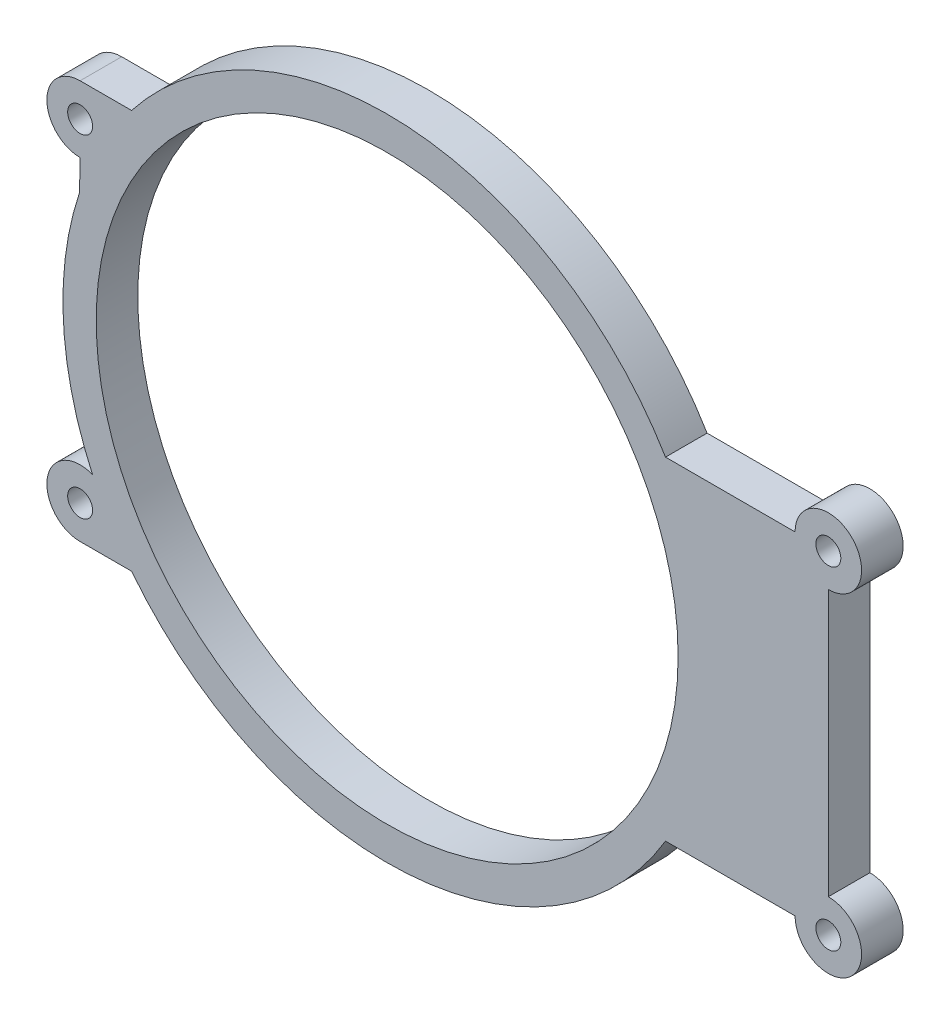
ISO-10303-21;
HEADER;
FILE_DESCRIPTION(('STEP AP214'),'2;1');
FILE_NAME('part.step','',(''),(''),'','','');
FILE_SCHEMA(('AUTOMOTIVE_DESIGN { 1 0 10303 214 1 1 1 1 }'));
ENDSEC;
DATA;
#1=APPLICATION_CONTEXT('core data for automotive mechanical design processes');
#2=APPLICATION_PROTOCOL_DEFINITION('international standard','automotive_design',2000,#1);
#3=PRODUCT_CONTEXT('',#1,'mechanical');
#4=PRODUCT('Part','Part','',(#3));
#5=PRODUCT_RELATED_PRODUCT_CATEGORY('part','',(#4));
#6=PRODUCT_DEFINITION_FORMATION('','',#4);
#7=PRODUCT_DEFINITION_CONTEXT('part definition',#1,'design');
#8=PRODUCT_DEFINITION('design','',#6,#7);
#9=PRODUCT_DEFINITION_SHAPE('','',#8);
#10=(LENGTH_UNIT() NAMED_UNIT(*) SI_UNIT(.MILLI.,.METRE.));
#11=(NAMED_UNIT(*) PLANE_ANGLE_UNIT() SI_UNIT($,.RADIAN.));
#12=(NAMED_UNIT(*) SI_UNIT($,.STERADIAN.) SOLID_ANGLE_UNIT());
#13=UNCERTAINTY_MEASURE_WITH_UNIT(LENGTH_MEASURE(1.E-05),#10,'distance_accuracy_value','');
#14=(GEOMETRIC_REPRESENTATION_CONTEXT(3) GLOBAL_UNCERTAINTY_ASSIGNED_CONTEXT((#13)) GLOBAL_UNIT_ASSIGNED_CONTEXT((#10,
#11,#12)) REPRESENTATION_CONTEXT('',''));
#15=CARTESIAN_POINT('',(0.,0.,0.));
#16=DIRECTION('',(0.,0.,1.));
#17=DIRECTION('',(1.,0.,0.));
#18=AXIS2_PLACEMENT_3D('',#15,#16,#17);
#19=CARTESIAN_POINT('',(0.,24.,5.));
#20=DIRECTION('',(0.,1.,0.));
#21=DIRECTION('',(0.,0.,1.));
#22=AXIS2_PLACEMENT_3D('',#19,#20,#21);
#23=PLANE('',#22);
#24=DIRECTION('',(1.,0.,0.));
#25=VECTOR('',#24,1.);
#26=CARTESIAN_POINT('',(0.,24.,0.));
#27=LINE('',#26,#25);
#28=CARTESIAN_POINT('',(-36.9323706252388,24.,0.));
#29=VERTEX_POINT('',#28);
#30=CARTESIAN_POINT('',(-30.7408522978788,24.,0.));
#31=VERTEX_POINT('',#30);
#32=EDGE_CURVE('E221',#29,#31,#27,.T.);
#33=ORIENTED_EDGE('',*,*,#32,.F.);
#34=DIRECTION('',(0.,0.,-1.));
#35=VECTOR('',#34,1.);
#36=CARTESIAN_POINT('',(-36.9323706252388,24.,5.));
#37=LINE('',#36,#35);
#38=CARTESIAN_POINT('',(-36.9323706252388,24.,5.));
#39=VERTEX_POINT('',#38);
#40=EDGE_CURVE('E11',#39,#29,#37,.T.);
#41=ORIENTED_EDGE('',*,*,#40,.F.);
#42=DIRECTION('',(1.,0.,0.));
#43=VECTOR('',#42,1.);
#44=CARTESIAN_POINT('',(0.,24.,5.));
#45=LINE('',#44,#43);
#46=CARTESIAN_POINT('',(-30.7408522978788,24.,5.));
#47=VERTEX_POINT('',#46);
#48=EDGE_CURVE('E361',#39,#47,#45,.T.);
#49=ORIENTED_EDGE('',*,*,#48,.T.);
#50=DIRECTION('',(0.,0.,-1.));
#51=VECTOR('',#50,1.);
#52=CARTESIAN_POINT('',(-30.7408522978788,24.,5.));
#53=LINE('',#52,#51);
#54=EDGE_CURVE('E112',#47,#31,#53,.T.);
#55=ORIENTED_EDGE('',*,*,#54,.T.);
#56=EDGE_LOOP('',(#33,#41,#49,#55));
#57=FACE_BOUND('',#56,.T.);
#58=ADVANCED_FACE('F45',(#57),#23,.T.);
#59=CARTESIAN_POINT('',(-36.9323706252388,20.,5.));
#60=DIRECTION('',(0.,0.,-1.));
#61=DIRECTION('',(-1.,0.,0.));
#62=AXIS2_PLACEMENT_3D('',#59,#60,#61);
#63=CYLINDRICAL_SURFACE('',#62,4.);
#64=CARTESIAN_POINT('',(-36.9323706252388,20.,0.));
#65=DIRECTION('',(0.,0.,1.));
#66=DIRECTION('',(1.,0.,0.));
#67=AXIS2_PLACEMENT_3D('',#64,#65,#66);
#68=CIRCLE('',#67,4.);
#69=CARTESIAN_POINT('',(-36.9323706252388,16.,0.));
#70=VERTEX_POINT('',#69);
#71=EDGE_CURVE('E218',#29,#70,#68,.T.);
#72=ORIENTED_EDGE('',*,*,#71,.T.);
#73=DIRECTION('',(0.,0.,-1.));
#74=VECTOR('',#73,1.);
#75=CARTESIAN_POINT('',(-36.9323706252388,16.,5.));
#76=LINE('',#75,#74);
#77=CARTESIAN_POINT('',(-36.9323706252388,16.,5.));
#78=VERTEX_POINT('',#77);
#79=EDGE_CURVE('E55',#78,#70,#76,.T.);
#80=ORIENTED_EDGE('',*,*,#79,.F.);
#81=CARTESIAN_POINT('',(-36.9323706252388,20.,5.));
#82=DIRECTION('',(0.,0.,1.));
#83=DIRECTION('',(1.,0.,0.));
#84=AXIS2_PLACEMENT_3D('',#81,#82,#83);
#85=CIRCLE('',#84,4.);
#86=EDGE_CURVE('E364',#39,#78,#85,.T.);
#87=ORIENTED_EDGE('',*,*,#86,.F.);
#88=ORIENTED_EDGE('',*,*,#40,.T.);
#89=EDGE_LOOP('',(#72,#80,#87,#88));
#90=FACE_BOUND('',#89,.T.);
#91=ADVANCED_FACE('F219',(#90),#63,.T.);
#92=CARTESIAN_POINT('',(-37.2251242057129,0.712873570111216,5.));
#93=DIRECTION('',(0.999816682769667,-0.0191468236388955,0.));
#94=DIRECTION('',(0.0191468236388955,0.999816682769667,0.));
#95=AXIS2_PLACEMENT_3D('',#92,#93,#94);
#96=PLANE('',#95);
#97=DIRECTION('',(-0.0191468236388955,-0.999816682769667,0.));
#98=VECTOR('',#97,1.);
#99=CARTESIAN_POINT('',(-37.2251242057129,0.712873570111216,0.));
#100=LINE('',#99,#98);
#101=CARTESIAN_POINT('',(-37.0028379618966,12.320307738268,0.));
#102=VERTEX_POINT('',#101);
#103=EDGE_CURVE('E212',#70,#102,#100,.T.);
#104=ORIENTED_EDGE('',*,*,#103,.T.);
#105=DIRECTION('',(0.,0.,-1.));
#106=VECTOR('',#105,1.);
#107=CARTESIAN_POINT('',(-37.0028379618966,12.320307738268,5.));
#108=LINE('',#107,#106);
#109=CARTESIAN_POINT('',(-37.0028379618966,12.320307738268,5.));
#110=VERTEX_POINT('',#109);
#111=EDGE_CURVE('E201',#110,#102,#108,.T.);
#112=ORIENTED_EDGE('',*,*,#111,.F.);
#113=DIRECTION('',(-0.0191468236388955,-0.999816682769667,0.));
#114=VECTOR('',#113,1.);
#115=CARTESIAN_POINT('',(-37.2251242057129,0.712873570111216,5.));
#116=LINE('',#115,#114);
#117=EDGE_CURVE('E214',#78,#110,#116,.T.);
#118=ORIENTED_EDGE('',*,*,#117,.F.);
#119=ORIENTED_EDGE('',*,*,#79,.T.);
#120=EDGE_LOOP('',(#104,#112,#118,#119));
#121=FACE_BOUND('',#120,.T.);
#122=ADVANCED_FACE('F210',(#121),#96,.F.);
#123=CARTESIAN_POINT('',(0.,0.,5.));
#124=DIRECTION('',(0.,0.,-1.));
#125=DIRECTION('',(-1.,0.,0.));
#126=AXIS2_PLACEMENT_3D('',#123,#124,#125);
#127=CYLINDRICAL_SURFACE('',#126,39.);
#128=CARTESIAN_POINT('',(0.,0.,0.));
#129=DIRECTION('',(0.,0.,1.));
#130=DIRECTION('',(1.,0.,0.));
#131=AXIS2_PLACEMENT_3D('',#128,#129,#130);
#132=CIRCLE('',#131,39.);
#133=CARTESIAN_POINT('',(-35.4344691984987,-16.291052532622,0.));
#134=VERTEX_POINT('',#133);
#135=EDGE_CURVE('E225',#102,#134,#132,.T.);
#136=ORIENTED_EDGE('',*,*,#135,.T.);
#137=DIRECTION('',(0.,0.,-1.));
#138=VECTOR('',#137,1.);
#139=CARTESIAN_POINT('',(-35.4344691984987,-16.291052532622,5.));
#140=LINE('',#139,#138);
#141=CARTESIAN_POINT('',(-35.4344691984987,-16.291052532622,5.));
#142=VERTEX_POINT('',#141);
#143=EDGE_CURVE('E197',#142,#134,#140,.T.);
#144=ORIENTED_EDGE('',*,*,#143,.F.);
#145=CARTESIAN_POINT('',(0.,0.,5.));
#146=DIRECTION('',(0.,0.,1.));
#147=DIRECTION('',(1.,0.,0.));
#148=AXIS2_PLACEMENT_3D('',#145,#146,#147);
#149=CIRCLE('',#148,39.);
#150=EDGE_CURVE('E371',#110,#142,#149,.T.);
#151=ORIENTED_EDGE('',*,*,#150,.F.);
#152=ORIENTED_EDGE('',*,*,#111,.T.);
#153=EDGE_LOOP('',(#136,#144,#151,#152));
#154=FACE_BOUND('',#153,.T.);
#155=ADVANCED_FACE('F307',(#154),#127,.T.);
#156=CARTESIAN_POINT('',(-36.9323706252388,-20.,5.));
#157=DIRECTION('',(0.,0.,-1.));
#158=DIRECTION('',(-1.,0.,0.));
#159=AXIS2_PLACEMENT_3D('',#156,#157,#158);
#160=CYLINDRICAL_SURFACE('',#159,4.);
#161=CARTESIAN_POINT('',(-36.9323706252388,-20.,0.));
#162=DIRECTION('',(0.,0.,1.));
#163=DIRECTION('',(1.,0.,0.));
#164=AXIS2_PLACEMENT_3D('',#161,#162,#163);
#165=CIRCLE('',#164,4.);
#166=CARTESIAN_POINT('',(-36.9323706252388,-24.,0.));
#167=VERTEX_POINT('',#166);
#168=EDGE_CURVE('E234',#134,#167,#165,.T.);
#169=ORIENTED_EDGE('',*,*,#168,.T.);
#170=DIRECTION('',(0.,0.,-1.));
#171=VECTOR('',#170,1.);
#172=CARTESIAN_POINT('',(-36.9323706252388,-24.,5.));
#173=LINE('',#172,#171);
#174=CARTESIAN_POINT('',(-36.9323706252388,-24.,5.));
#175=VERTEX_POINT('',#174);
#176=EDGE_CURVE('E193',#175,#167,#173,.T.);
#177=ORIENTED_EDGE('',*,*,#176,.F.);
#178=CARTESIAN_POINT('',(-36.9323706252388,-20.,5.));
#179=DIRECTION('',(0.,0.,1.));
#180=DIRECTION('',(1.,0.,0.));
#181=AXIS2_PLACEMENT_3D('',#178,#179,#180);
#182=CIRCLE('',#181,4.);
#183=EDGE_CURVE('E375',#142,#175,#182,.T.);
#184=ORIENTED_EDGE('',*,*,#183,.F.);
#185=ORIENTED_EDGE('',*,*,#143,.T.);
#186=EDGE_LOOP('',(#169,#177,#184,#185));
#187=FACE_BOUND('',#186,.T.);
#188=ADVANCED_FACE('F318',(#187),#160,.T.);
#189=CARTESIAN_POINT('',(0.,-24.,5.));
#190=DIRECTION('',(0.,1.,0.));
#191=DIRECTION('',(0.,0.,1.));
#192=AXIS2_PLACEMENT_3D('',#189,#190,#191);
#193=PLANE('',#192);
#194=DIRECTION('',(1.,0.,0.));
#195=VECTOR('',#194,1.);
#196=CARTESIAN_POINT('',(0.,-24.,0.));
#197=LINE('',#196,#195);
#198=CARTESIAN_POINT('',(-30.7408522978788,-24.,0.));
#199=VERTEX_POINT('',#198);
#200=EDGE_CURVE('E239',#167,#199,#197,.T.);
#201=ORIENTED_EDGE('',*,*,#200,.T.);
#202=DIRECTION('',(0.,0.,-1.));
#203=VECTOR('',#202,1.);
#204=CARTESIAN_POINT('',(-30.7408522978788,-24.,5.));
#205=LINE('',#204,#203);
#206=CARTESIAN_POINT('',(-30.7408522978788,-24.,5.));
#207=VERTEX_POINT('',#206);
#208=EDGE_CURVE('E189',#207,#199,#205,.T.);
#209=ORIENTED_EDGE('',*,*,#208,.F.);
#210=DIRECTION('',(1.,0.,0.));
#211=VECTOR('',#210,1.);
#212=CARTESIAN_POINT('',(0.,-24.,5.));
#213=LINE('',#212,#211);
#214=EDGE_CURVE('E380',#175,#207,#213,.T.);
#215=ORIENTED_EDGE('',*,*,#214,.F.);
#216=ORIENTED_EDGE('',*,*,#176,.T.);
#217=EDGE_LOOP('',(#201,#209,#215,#216));
#218=FACE_BOUND('',#217,.T.);
#219=ADVANCED_FACE('F321',(#218),#193,.F.);
#220=CARTESIAN_POINT('',(33.4813380855664,-20.,0.));
#221=VERTEX_POINT('',#220);
#222=EDGE_CURVE('E235',#199,#221,#132,.T.);
#223=ORIENTED_EDGE('',*,*,#222,.T.);
#224=DIRECTION('',(0.,0.,-1.));
#225=VECTOR('',#224,1.);
#226=CARTESIAN_POINT('',(33.4813380855664,-20.,5.));
#227=LINE('',#226,#225);
#228=CARTESIAN_POINT('',(33.4813380855664,-20.,5.));
#229=VERTEX_POINT('',#228);
#230=EDGE_CURVE('E186',#229,#221,#227,.T.);
#231=ORIENTED_EDGE('',*,*,#230,.F.);
#232=EDGE_CURVE('E376',#207,#229,#149,.T.);
#233=ORIENTED_EDGE('',*,*,#232,.F.);
#234=ORIENTED_EDGE('',*,*,#208,.T.);
#235=EDGE_LOOP('',(#223,#231,#233,#234));
#236=FACE_BOUND('',#235,.T.);
#237=ADVANCED_FACE('F308',(#236),#127,.T.);
#238=CARTESIAN_POINT('',(0.,-20.,5.));
#239=DIRECTION('',(0.,-1.,0.));
#240=DIRECTION('',(1.,0.,0.));
#241=AXIS2_PLACEMENT_3D('',#238,#239,#240);
#242=PLANE('',#241);
#243=DIRECTION('',(-1.,0.,0.));
#244=VECTOR('',#243,1.);
#245=CARTESIAN_POINT('',(0.,-20.,0.));
#246=LINE('',#245,#244);
#247=CARTESIAN_POINT('',(49.0676293747612,-20.,0.));
#248=VERTEX_POINT('',#247);
#249=EDGE_CURVE('E243',#248,#221,#246,.T.);
#250=ORIENTED_EDGE('',*,*,#249,.F.);
#251=DIRECTION('',(0.,0.,-1.));
#252=VECTOR('',#251,1.);
#253=CARTESIAN_POINT('',(49.0676293747612,-20.,5.));
#254=LINE('',#253,#252);
#255=CARTESIAN_POINT('',(49.0676293747612,-20.,5.));
#256=VERTEX_POINT('',#255);
#257=EDGE_CURVE('E183',#256,#248,#254,.T.);
#258=ORIENTED_EDGE('',*,*,#257,.F.);
#259=DIRECTION('',(-1.,0.,0.));
#260=VECTOR('',#259,1.);
#261=CARTESIAN_POINT('',(0.,-20.,5.));
#262=LINE('',#261,#260);
#263=EDGE_CURVE('E384',#256,#229,#262,.T.);
#264=ORIENTED_EDGE('',*,*,#263,.T.);
#265=ORIENTED_EDGE('',*,*,#230,.T.);
#266=EDGE_LOOP('',(#250,#258,#264,#265));
#267=FACE_BOUND('',#266,.T.);
#268=ADVANCED_FACE('F326',(#267),#242,.T.);
#269=CARTESIAN_POINT('',(53.0676293747612,-20.,5.));
#270=DIRECTION('',(0.,0.,-1.));
#271=DIRECTION('',(-1.,0.,0.));
#272=AXIS2_PLACEMENT_3D('',#269,#270,#271);
#273=CYLINDRICAL_SURFACE('',#272,4.);
#274=CARTESIAN_POINT('',(53.0676293747612,-20.,0.));
#275=DIRECTION('',(0.,0.,1.));
#276=DIRECTION('',(1.,0.,0.));
#277=AXIS2_PLACEMENT_3D('',#274,#275,#276);
#278=CIRCLE('',#277,4.);
#279=CARTESIAN_POINT('',(53.0676293747612,-16.,0.));
#280=VERTEX_POINT('',#279);
#281=EDGE_CURVE('E247',#248,#280,#278,.T.);
#282=ORIENTED_EDGE('',*,*,#281,.T.);
#283=DIRECTION('',(0.,0.,-1.));
#284=VECTOR('',#283,1.);
#285=CARTESIAN_POINT('',(53.0676293747612,-16.,5.));
#286=LINE('',#285,#284);
#287=CARTESIAN_POINT('',(53.0676293747612,-16.,5.));
#288=VERTEX_POINT('',#287);
#289=EDGE_CURVE('E175',#288,#280,#286,.T.);
#290=ORIENTED_EDGE('',*,*,#289,.F.);
#291=CARTESIAN_POINT('',(53.0676293747612,-20.,5.));
#292=DIRECTION('',(0.,0.,1.));
#293=DIRECTION('',(1.,0.,0.));
#294=AXIS2_PLACEMENT_3D('',#291,#292,#293);
#295=CIRCLE('',#294,4.);
#296=EDGE_CURVE('E388',#256,#288,#295,.T.);
#297=ORIENTED_EDGE('',*,*,#296,.F.);
#298=ORIENTED_EDGE('',*,*,#257,.T.);
#299=EDGE_LOOP('',(#282,#290,#297,#298));
#300=FACE_BOUND('',#299,.T.);
#301=ADVANCED_FACE('F329',(#300),#273,.T.);
#302=CARTESIAN_POINT('',(53.0676293747612,0.,5.));
#303=DIRECTION('',(-1.,0.,0.));
#304=DIRECTION('',(0.,-1.,0.));
#305=AXIS2_PLACEMENT_3D('',#302,#303,#304);
#306=PLANE('',#305);
#307=DIRECTION('',(0.,1.,0.));
#308=VECTOR('',#307,1.);
#309=CARTESIAN_POINT('',(53.0676293747612,0.,0.));
#310=LINE('',#309,#308);
#311=CARTESIAN_POINT('',(53.0676293747612,16.,0.));
#312=VERTEX_POINT('',#311);
#313=EDGE_CURVE('E251',#280,#312,#310,.T.);
#314=ORIENTED_EDGE('',*,*,#313,.T.);
#315=DIRECTION('',(0.,0.,-1.));
#316=VECTOR('',#315,1.);
#317=CARTESIAN_POINT('',(53.0676293747612,16.,5.));
#318=LINE('',#317,#316);
#319=CARTESIAN_POINT('',(53.0676293747612,16.,5.));
#320=VERTEX_POINT('',#319);
#321=EDGE_CURVE('E171',#320,#312,#318,.T.);
#322=ORIENTED_EDGE('',*,*,#321,.F.);
#323=DIRECTION('',(0.,1.,0.));
#324=VECTOR('',#323,1.);
#325=CARTESIAN_POINT('',(53.0676293747612,0.,5.));
#326=LINE('',#325,#324);
#327=EDGE_CURVE('E162',#288,#320,#326,.T.);
#328=ORIENTED_EDGE('',*,*,#327,.F.);
#329=ORIENTED_EDGE('',*,*,#289,.T.);
#330=EDGE_LOOP('',(#314,#322,#328,#329));
#331=FACE_BOUND('',#330,.T.);
#332=ADVANCED_FACE('F333',(#331),#306,.F.);
#333=CARTESIAN_POINT('',(53.0676293747612,20.,5.));
#334=DIRECTION('',(0.,0.,-1.));
#335=DIRECTION('',(-1.,0.,0.));
#336=AXIS2_PLACEMENT_3D('',#333,#334,#335);
#337=CYLINDRICAL_SURFACE('',#336,4.00000000000001);
#338=CARTESIAN_POINT('',(53.0676293747612,20.,0.));
#339=DIRECTION('',(0.,0.,1.));
#340=DIRECTION('',(1.,0.,0.));
#341=AXIS2_PLACEMENT_3D('',#338,#339,#340);
#342=CIRCLE('',#341,4.00000000000001);
#343=CARTESIAN_POINT('',(49.0676293747612,20.,0.));
#344=VERTEX_POINT('',#343);
#345=EDGE_CURVE('E169',#312,#344,#342,.T.);
#346=ORIENTED_EDGE('',*,*,#345,.T.);
#347=DIRECTION('',(0.,0.,-1.));
#348=VECTOR('',#347,1.);
#349=CARTESIAN_POINT('',(49.0676293747612,20.,5.));
#350=LINE('',#349,#348);
#351=CARTESIAN_POINT('',(49.0676293747612,20.,5.));
#352=VERTEX_POINT('',#351);
#353=EDGE_CURVE('E152',#352,#344,#350,.T.);
#354=ORIENTED_EDGE('',*,*,#353,.F.);
#355=CARTESIAN_POINT('',(53.0676293747612,20.,5.));
#356=DIRECTION('',(0.,0.,1.));
#357=DIRECTION('',(1.,0.,0.));
#358=AXIS2_PLACEMENT_3D('',#355,#356,#357);
#359=CIRCLE('',#358,4.00000000000001);
#360=EDGE_CURVE('E156',#320,#352,#359,.T.);
#361=ORIENTED_EDGE('',*,*,#360,.F.);
#362=ORIENTED_EDGE('',*,*,#321,.T.);
#363=EDGE_LOOP('',(#346,#354,#361,#362));
#364=FACE_BOUND('',#363,.T.);
#365=ADVANCED_FACE('F168',(#364),#337,.T.);
#366=CARTESIAN_POINT('',(0.,20.,5.));
#367=DIRECTION('',(0.,-1.,0.));
#368=DIRECTION('',(1.,0.,0.));
#369=AXIS2_PLACEMENT_3D('',#366,#367,#368);
#370=PLANE('',#369);
#371=DIRECTION('',(-1.,0.,0.));
#372=VECTOR('',#371,1.);
#373=CARTESIAN_POINT('',(0.,20.,0.));
#374=LINE('',#373,#372);
#375=CARTESIAN_POINT('',(33.4813380855664,20.,0.));
#376=VERTEX_POINT('',#375);
#377=EDGE_CURVE('E257',#344,#376,#374,.T.);
#378=ORIENTED_EDGE('',*,*,#377,.T.);
#379=DIRECTION('',(0.,0.,-1.));
#380=VECTOR('',#379,1.);
#381=CARTESIAN_POINT('',(33.4813380855664,20.,5.));
#382=LINE('',#381,#380);
#383=CARTESIAN_POINT('',(33.4813380855664,20.,5.));
#384=VERTEX_POINT('',#383);
#385=EDGE_CURVE('E154',#384,#376,#382,.T.);
#386=ORIENTED_EDGE('',*,*,#385,.F.);
#387=DIRECTION('',(-1.,0.,0.));
#388=VECTOR('',#387,1.);
#389=CARTESIAN_POINT('',(0.,20.,5.));
#390=LINE('',#389,#388);
#391=EDGE_CURVE('E147',#352,#384,#390,.T.);
#392=ORIENTED_EDGE('',*,*,#391,.F.);
#393=ORIENTED_EDGE('',*,*,#353,.T.);
#394=EDGE_LOOP('',(#378,#386,#392,#393));
#395=FACE_BOUND('',#394,.T.);
#396=ADVANCED_FACE('F150',(#395),#370,.F.);
#397=CARTESIAN_POINT('',(53.0676293747612,-20.,5.));
#398=DIRECTION('',(0.,0.,-1.));
#399=DIRECTION('',(-1.,0.,0.));
#400=AXIS2_PLACEMENT_3D('',#397,#398,#399);
#401=CYLINDRICAL_SURFACE('',#400,1.5);
#402=CARTESIAN_POINT('',(53.0676293747612,-20.,5.));
#403=DIRECTION('',(0.,0.,1.));
#404=DIRECTION('',(1.,0.,0.));
#405=AXIS2_PLACEMENT_3D('',#402,#403,#404);
#406=CIRCLE('',#405,1.5);
#407=CARTESIAN_POINT('',(54.5676293747612,-20.,5.));
#408=VERTEX_POINT('',#407);
#409=EDGE_CURVE('E280',#408,#408,#406,.T.);
#410=ORIENTED_EDGE('',*,*,#409,.T.);
#411=EDGE_LOOP('',(#410));
#412=FACE_BOUND('',#411,.T.);
#413=CARTESIAN_POINT('',(53.0676293747612,-20.,0.));
#414=DIRECTION('',(0.,0.,1.));
#415=DIRECTION('',(1.,0.,0.));
#416=AXIS2_PLACEMENT_3D('',#413,#414,#415);
#417=CIRCLE('',#416,1.5);
#418=CARTESIAN_POINT('',(54.5676293747612,-20.,0.));
#419=VERTEX_POINT('',#418);
#420=EDGE_CURVE('E268',#419,#419,#417,.T.);
#421=ORIENTED_EDGE('',*,*,#420,.F.);
#422=EDGE_LOOP('',(#421));
#423=FACE_BOUND('',#422,.T.);
#424=ADVANCED_FACE('F341',(#412,#423),#401,.F.);
#425=CARTESIAN_POINT('',(53.0676293747612,20.,5.));
#426=DIRECTION('',(0.,0.,-1.));
#427=DIRECTION('',(-1.,0.,0.));
#428=AXIS2_PLACEMENT_3D('',#425,#426,#427);
#429=CYLINDRICAL_SURFACE('',#428,1.5);
#430=CARTESIAN_POINT('',(53.0676293747612,20.,5.));
#431=DIRECTION('',(0.,0.,1.));
#432=DIRECTION('',(1.,0.,0.));
#433=AXIS2_PLACEMENT_3D('',#430,#431,#432);
#434=CIRCLE('',#433,1.5);
#435=CARTESIAN_POINT('',(54.5676293747612,20.,5.));
#436=VERTEX_POINT('',#435);
#437=EDGE_CURVE('E286',#436,#436,#434,.T.);
#438=ORIENTED_EDGE('',*,*,#437,.T.);
#439=EDGE_LOOP('',(#438));
#440=FACE_BOUND('',#439,.T.);
#441=CARTESIAN_POINT('',(53.0676293747612,20.,0.));
#442=DIRECTION('',(0.,0.,1.));
#443=DIRECTION('',(1.,0.,0.));
#444=AXIS2_PLACEMENT_3D('',#441,#442,#443);
#445=CIRCLE('',#444,1.5);
#446=CARTESIAN_POINT('',(54.5676293747612,20.,0.));
#447=VERTEX_POINT('',#446);
#448=EDGE_CURVE('E264',#447,#447,#445,.T.);
#449=ORIENTED_EDGE('',*,*,#448,.F.);
#450=EDGE_LOOP('',(#449));
#451=FACE_BOUND('',#450,.T.);
#452=ADVANCED_FACE('F345',(#440,#451),#429,.F.);
#453=CARTESIAN_POINT('',(-36.9323706252388,-20.,5.));
#454=DIRECTION('',(0.,0.,-1.));
#455=DIRECTION('',(-1.,0.,0.));
#456=AXIS2_PLACEMENT_3D('',#453,#454,#455);
#457=CYLINDRICAL_SURFACE('',#456,1.5);
#458=CARTESIAN_POINT('',(-36.9323706252388,-20.,5.));
#459=DIRECTION('',(0.,0.,1.));
#460=DIRECTION('',(1.,0.,0.));
#461=AXIS2_PLACEMENT_3D('',#458,#459,#460);
#462=CIRCLE('',#461,1.5);
#463=CARTESIAN_POINT('',(-35.4323706252388,-20.,5.));
#464=VERTEX_POINT('',#463);
#465=EDGE_CURVE('E393',#464,#464,#462,.T.);
#466=ORIENTED_EDGE('',*,*,#465,.T.);
#467=EDGE_LOOP('',(#466));
#468=FACE_BOUND('',#467,.T.);
#469=CARTESIAN_POINT('',(-36.9323706252388,-20.,0.));
#470=DIRECTION('',(0.,0.,1.));
#471=DIRECTION('',(1.,0.,0.));
#472=AXIS2_PLACEMENT_3D('',#469,#470,#471);
#473=CIRCLE('',#472,1.5);
#474=CARTESIAN_POINT('',(-35.4323706252388,-20.,0.));
#475=VERTEX_POINT('',#474);
#476=EDGE_CURVE('E260',#475,#475,#473,.T.);
#477=ORIENTED_EDGE('',*,*,#476,.F.);
#478=EDGE_LOOP('',(#477));
#479=FACE_BOUND('',#478,.T.);
#480=ADVANCED_FACE('F304',(#468,#479),#457,.F.);
#481=EDGE_CURVE('E105',#376,#31,#132,.T.);
#482=ORIENTED_EDGE('',*,*,#481,.T.);
#483=ORIENTED_EDGE('',*,*,#54,.F.);
#484=EDGE_CURVE('E63',#384,#47,#149,.T.);
#485=ORIENTED_EDGE('',*,*,#484,.F.);
#486=ORIENTED_EDGE('',*,*,#385,.T.);
#487=EDGE_LOOP('',(#482,#483,#485,#486));
#488=FACE_BOUND('',#487,.T.);
#489=ADVANCED_FACE('F297',(#488),#127,.T.);
#490=CARTESIAN_POINT('',(0.,0.,5.));
#491=DIRECTION('',(0.,0.,-1.));
#492=DIRECTION('',(-1.,0.,0.));
#493=AXIS2_PLACEMENT_3D('',#490,#491,#492);
#494=CYLINDRICAL_SURFACE('',#493,35.);
#495=CARTESIAN_POINT('',(0.,0.,5.));
#496=DIRECTION('',(0.,0.,1.));
#497=DIRECTION('',(1.,0.,0.));
#498=AXIS2_PLACEMENT_3D('',#495,#496,#497);
#499=CIRCLE('',#498,35.);
#500=CARTESIAN_POINT('',(35.,0.,5.));
#501=VERTEX_POINT('',#500);
#502=EDGE_CURVE('E275',#501,#501,#499,.T.);
#503=ORIENTED_EDGE('',*,*,#502,.T.);
#504=EDGE_LOOP('',(#503));
#505=FACE_BOUND('',#504,.T.);
#506=CARTESIAN_POINT('',(0.,0.,0.));
#507=DIRECTION('',(0.,0.,1.));
#508=DIRECTION('',(1.,0.,0.));
#509=AXIS2_PLACEMENT_3D('',#506,#507,#508);
#510=CIRCLE('',#509,35.);
#511=CARTESIAN_POINT('',(35.,0.,0.));
#512=VERTEX_POINT('',#511);
#513=EDGE_CURVE('E227',#512,#512,#510,.T.);
#514=ORIENTED_EDGE('',*,*,#513,.F.);
#515=EDGE_LOOP('',(#514));
#516=FACE_BOUND('',#515,.T.);
#517=ADVANCED_FACE('F47',(#505,#516),#494,.F.);
#518=CARTESIAN_POINT('',(-36.9323706252388,20.,5.));
#519=DIRECTION('',(0.,0.,-1.));
#520=DIRECTION('',(-1.,0.,0.));
#521=AXIS2_PLACEMENT_3D('',#518,#519,#520);
#522=CYLINDRICAL_SURFACE('',#521,1.5);
#523=CARTESIAN_POINT('',(-36.9323706252388,20.,5.));
#524=DIRECTION('',(0.,0.,1.));
#525=DIRECTION('',(1.,0.,0.));
#526=AXIS2_PLACEMENT_3D('',#523,#524,#525);
#527=CIRCLE('',#526,1.5);
#528=CARTESIAN_POINT('',(-35.4323706252388,20.,5.));
#529=VERTEX_POINT('',#528);
#530=EDGE_CURVE('E277',#529,#529,#527,.T.);
#531=ORIENTED_EDGE('',*,*,#530,.T.);
#532=EDGE_LOOP('',(#531));
#533=FACE_BOUND('',#532,.T.);
#534=CARTESIAN_POINT('',(-36.9323706252388,20.,0.));
#535=DIRECTION('',(0.,0.,1.));
#536=DIRECTION('',(1.,0.,0.));
#537=AXIS2_PLACEMENT_3D('',#534,#535,#536);
#538=CIRCLE('',#537,1.5);
#539=CARTESIAN_POINT('',(-35.4323706252388,20.,0.));
#540=VERTEX_POINT('',#539);
#541=EDGE_CURVE('E272',#540,#540,#538,.T.);
#542=ORIENTED_EDGE('',*,*,#541,.F.);
#543=EDGE_LOOP('',(#542));
#544=FACE_BOUND('',#543,.T.);
#545=ADVANCED_FACE('F296',(#533,#544),#522,.F.);
#546=CARTESIAN_POINT('',(0.,0.,5.));
#547=DIRECTION('',(0.,0.,1.));
#548=DIRECTION('',(1.,0.,0.));
#549=AXIS2_PLACEMENT_3D('',#546,#547,#548);
#550=PLANE('',#549);
#551=ORIENTED_EDGE('',*,*,#502,.F.);
#552=EDGE_LOOP('',(#551));
#553=FACE_BOUND('',#552,.T.);
#554=ORIENTED_EDGE('',*,*,#48,.F.);
#555=ORIENTED_EDGE('',*,*,#86,.T.);
#556=ORIENTED_EDGE('',*,*,#117,.T.);
#557=ORIENTED_EDGE('',*,*,#150,.T.);
#558=ORIENTED_EDGE('',*,*,#183,.T.);
#559=ORIENTED_EDGE('',*,*,#214,.T.);
#560=ORIENTED_EDGE('',*,*,#232,.T.);
#561=ORIENTED_EDGE('',*,*,#263,.F.);
#562=ORIENTED_EDGE('',*,*,#296,.T.);
#563=ORIENTED_EDGE('',*,*,#327,.T.);
#564=ORIENTED_EDGE('',*,*,#360,.T.);
#565=ORIENTED_EDGE('',*,*,#391,.T.);
#566=ORIENTED_EDGE('',*,*,#484,.T.);
#567=EDGE_LOOP('',(#554,#555,#556,#557,#558,#559,#560,#561,#562,#563,#564,#565,#566));
#568=FACE_BOUND('',#567,.T.);
#569=ORIENTED_EDGE('',*,*,#465,.F.);
#570=EDGE_LOOP('',(#569));
#571=FACE_BOUND('',#570,.T.);
#572=ORIENTED_EDGE('',*,*,#437,.F.);
#573=EDGE_LOOP('',(#572));
#574=FACE_BOUND('',#573,.T.);
#575=ORIENTED_EDGE('',*,*,#409,.F.);
#576=EDGE_LOOP('',(#575));
#577=FACE_BOUND('',#576,.T.);
#578=ORIENTED_EDGE('',*,*,#530,.F.);
#579=EDGE_LOOP('',(#578));
#580=FACE_BOUND('',#579,.T.);
#581=ADVANCED_FACE('F159',(#553,#568,#571,#574,#577,#580),#550,.T.);
#582=CARTESIAN_POINT('',(0.,0.,0.));
#583=DIRECTION('',(0.,0.,1.));
#584=DIRECTION('',(1.,0.,0.));
#585=AXIS2_PLACEMENT_3D('',#582,#583,#584);
#586=PLANE('',#585);
#587=ORIENTED_EDGE('',*,*,#513,.T.);
#588=EDGE_LOOP('',(#587));
#589=FACE_BOUND('',#588,.T.);
#590=ORIENTED_EDGE('',*,*,#32,.T.);
#591=ORIENTED_EDGE('',*,*,#481,.F.);
#592=ORIENTED_EDGE('',*,*,#377,.F.);
#593=ORIENTED_EDGE('',*,*,#345,.F.);
#594=ORIENTED_EDGE('',*,*,#313,.F.);
#595=ORIENTED_EDGE('',*,*,#281,.F.);
#596=ORIENTED_EDGE('',*,*,#249,.T.);
#597=ORIENTED_EDGE('',*,*,#222,.F.);
#598=ORIENTED_EDGE('',*,*,#200,.F.);
#599=ORIENTED_EDGE('',*,*,#168,.F.);
#600=ORIENTED_EDGE('',*,*,#135,.F.);
#601=ORIENTED_EDGE('',*,*,#103,.F.);
#602=ORIENTED_EDGE('',*,*,#71,.F.);
#603=EDGE_LOOP('',(#590,#591,#592,#593,#594,#595,#596,#597,#598,#599,#600,#601,#602));
#604=FACE_BOUND('',#603,.T.);
#605=ORIENTED_EDGE('',*,*,#476,.T.);
#606=EDGE_LOOP('',(#605));
#607=FACE_BOUND('',#606,.T.);
#608=ORIENTED_EDGE('',*,*,#448,.T.);
#609=EDGE_LOOP('',(#608));
#610=FACE_BOUND('',#609,.T.);
#611=ORIENTED_EDGE('',*,*,#420,.T.);
#612=EDGE_LOOP('',(#611));
#613=FACE_BOUND('',#612,.T.);
#614=ORIENTED_EDGE('',*,*,#541,.T.);
#615=EDGE_LOOP('',(#614));
#616=FACE_BOUND('',#615,.T.);
#617=ADVANCED_FACE('F293',(#589,#604,#607,#610,#613,#616),#586,.F.);
#618=CLOSED_SHELL('',(#58,#91,#122,#155,#188,#219,#237,#268,#301,#332,#365,#396,#424,#452,#480,
#489,#517,#545,#581,#617));
#619=MANIFOLD_SOLID_BREP('B2',#618);
#620=ADVANCED_BREP_SHAPE_REPRESENTATION('',(#18,#619),#14);
#621=SHAPE_DEFINITION_REPRESENTATION(#9,#620);
ENDSEC;
END-ISO-10303-21;
